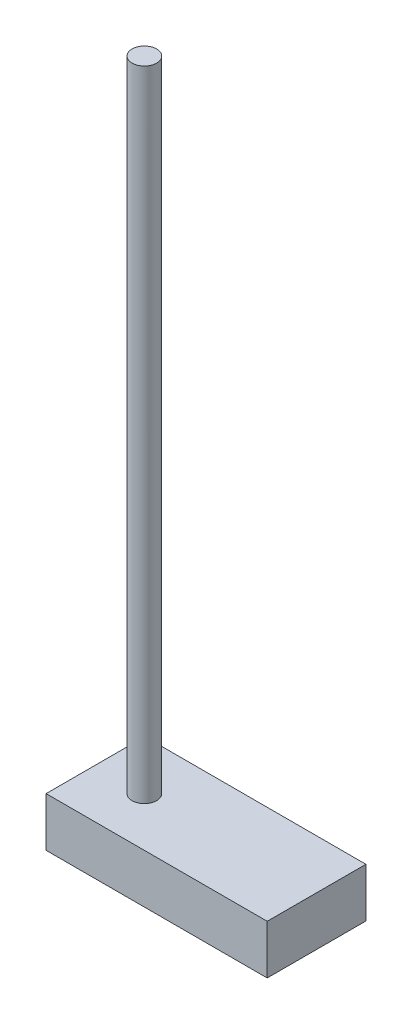
ISO-10303-21;
HEADER;
FILE_DESCRIPTION(('STEP AP214'),'2;1');
FILE_NAME('part.step','',(''),(''),'','','');
FILE_SCHEMA(('AUTOMOTIVE_DESIGN { 1 0 10303 214 1 1 1 1 }'));
ENDSEC;
DATA;
#1=APPLICATION_CONTEXT('core data for automotive mechanical design processes');
#2=APPLICATION_PROTOCOL_DEFINITION('international standard','automotive_design',2000,#1);
#3=PRODUCT_CONTEXT('',#1,'mechanical');
#4=PRODUCT('Part','Part','',(#3));
#5=PRODUCT_RELATED_PRODUCT_CATEGORY('part','',(#4));
#6=PRODUCT_DEFINITION_FORMATION('','',#4);
#7=PRODUCT_DEFINITION_CONTEXT('part definition',#1,'design');
#8=PRODUCT_DEFINITION('design','',#6,#7);
#9=PRODUCT_DEFINITION_SHAPE('','',#8);
#10=(LENGTH_UNIT() NAMED_UNIT(*) SI_UNIT(.MILLI.,.METRE.));
#11=(NAMED_UNIT(*) PLANE_ANGLE_UNIT() SI_UNIT($,.RADIAN.));
#12=(NAMED_UNIT(*) SI_UNIT($,.STERADIAN.) SOLID_ANGLE_UNIT());
#13=UNCERTAINTY_MEASURE_WITH_UNIT(LENGTH_MEASURE(1.E-05),#10,'distance_accuracy_value','');
#14=(GEOMETRIC_REPRESENTATION_CONTEXT(3) GLOBAL_UNCERTAINTY_ASSIGNED_CONTEXT((#13)) GLOBAL_UNIT_ASSIGNED_CONTEXT((#10,
#11,#12)) REPRESENTATION_CONTEXT('',''));
#15=CARTESIAN_POINT('',(0.,0.,0.));
#16=DIRECTION('',(0.,0.,1.));
#17=DIRECTION('',(1.,0.,0.));
#18=AXIS2_PLACEMENT_3D('',#15,#16,#17);
#19=CARTESIAN_POINT('',(0.,20.,0.));
#20=DIRECTION('',(0.,-1.,0.));
#21=DIRECTION('',(0.,0.,-1.));
#22=AXIS2_PLACEMENT_3D('',#19,#20,#21);
#23=CYLINDRICAL_SURFACE('',#22,2.5);
#24=CARTESIAN_POINT('',(0.,0.,0.));
#25=DIRECTION('',(0.,-1.,0.));
#26=DIRECTION('',(0.,0.,-1.));
#27=AXIS2_PLACEMENT_3D('',#24,#25,#26);
#28=CIRCLE('',#27,2.5);
#29=CARTESIAN_POINT('',(0.,0.,-2.5));
#30=VERTEX_POINT('',#29);
#31=EDGE_CURVE('E11',#30,#30,#28,.T.);
#32=ORIENTED_EDGE('',*,*,#31,.F.);
#33=EDGE_LOOP('',(#32));
#34=FACE_BOUND('',#33,.T.);
#35=CARTESIAN_POINT('',(0.,130.,0.));
#36=DIRECTION('',(0.,1.,0.));
#37=DIRECTION('',(0.,0.,1.));
#38=AXIS2_PLACEMENT_3D('',#35,#36,#37);
#39=CIRCLE('',#38,2.50000000000061);
#40=CARTESIAN_POINT('',(0.,130.,2.50000000000061));
#41=VERTEX_POINT('',#40);
#42=EDGE_CURVE('E102',#41,#41,#39,.T.);
#43=ORIENTED_EDGE('',*,*,#42,.F.);
#44=EDGE_LOOP('',(#43));
#45=FACE_BOUND('',#44,.T.);
#46=ADVANCED_FACE('F33',(#34,#45),#23,.T.);
#47=CARTESIAN_POINT('',(0.,0.,0.));
#48=DIRECTION('',(0.,-1.,0.));
#49=DIRECTION('',(0.,0.,-1.));
#50=AXIS2_PLACEMENT_3D('',#47,#48,#49);
#51=PLANE('',#50);
#52=DIRECTION('',(0.,0.,-1.));
#53=VECTOR('',#52,1.);
#54=CARTESIAN_POINT('',(-10.,0.,10.));
#55=LINE('',#54,#53);
#56=CARTESIAN_POINT('',(-10.,0.,10.));
#57=VERTEX_POINT('',#56);
#58=CARTESIAN_POINT('',(-10.,0.,-10.0875672703907));
#59=VERTEX_POINT('',#58);
#60=EDGE_CURVE('E99',#57,#59,#55,.T.);
#61=ORIENTED_EDGE('',*,*,#60,.F.);
#62=DIRECTION('',(-1.,0.,0.));
#63=VECTOR('',#62,1.);
#64=CARTESIAN_POINT('',(-10.,0.,10.));
#65=LINE('',#64,#63);
#66=CARTESIAN_POINT('',(35.0000000000096,0.,9.99999999999999));
#67=VERTEX_POINT('',#66);
#68=EDGE_CURVE('E72',#67,#57,#65,.T.);
#69=ORIENTED_EDGE('',*,*,#68,.F.);
#70=DIRECTION('',(0.,0.,1.));
#71=VECTOR('',#70,1.);
#72=CARTESIAN_POINT('',(35.0000000000096,0.,9.99999999999999));
#73=LINE('',#72,#71);
#74=CARTESIAN_POINT('',(35.0000000000096,0.,-10.0875672703907));
#75=VERTEX_POINT('',#74);
#76=EDGE_CURVE('E66',#75,#67,#73,.T.);
#77=ORIENTED_EDGE('',*,*,#76,.F.);
#78=DIRECTION('',(1.,0.,0.));
#79=VECTOR('',#78,1.);
#80=CARTESIAN_POINT('',(-10.,0.,-10.0875672703907));
#81=LINE('',#80,#79);
#82=EDGE_CURVE('E90',#59,#75,#81,.T.);
#83=ORIENTED_EDGE('',*,*,#82,.F.);
#84=EDGE_LOOP('',(#61,#69,#77,#83));
#85=FACE_BOUND('',#84,.T.);
#86=ORIENTED_EDGE('',*,*,#31,.T.);
#87=EDGE_LOOP('',(#86));
#88=FACE_BOUND('',#87,.T.);
#89=ADVANCED_FACE('F111',(#85,#88),#51,.F.);
#90=CARTESIAN_POINT('',(-10.,-10.,10.));
#91=DIRECTION('',(1.,0.,0.));
#92=DIRECTION('',(0.,0.,-1.));
#93=AXIS2_PLACEMENT_3D('',#90,#91,#92);
#94=PLANE('',#93);
#95=ORIENTED_EDGE('',*,*,#60,.T.);
#96=DIRECTION('',(0.,1.,0.));
#97=VECTOR('',#96,1.);
#98=CARTESIAN_POINT('',(-10.,-10.,-10.0875672703907));
#99=LINE('',#98,#97);
#100=CARTESIAN_POINT('',(-10.,-10.,-10.0875672703907));
#101=VERTEX_POINT('',#100);
#102=EDGE_CURVE('E41',#101,#59,#99,.T.);
#103=ORIENTED_EDGE('',*,*,#102,.F.);
#104=DIRECTION('',(0.,0.,-1.));
#105=VECTOR('',#104,1.);
#106=CARTESIAN_POINT('',(-10.,-10.,10.));
#107=LINE('',#106,#105);
#108=CARTESIAN_POINT('',(-10.,-10.,10.));
#109=VERTEX_POINT('',#108);
#110=EDGE_CURVE('E85',#109,#101,#107,.T.);
#111=ORIENTED_EDGE('',*,*,#110,.F.);
#112=DIRECTION('',(0.,1.,0.));
#113=VECTOR('',#112,1.);
#114=CARTESIAN_POINT('',(-10.,-10.,10.));
#115=LINE('',#114,#113);
#116=EDGE_CURVE('E95',#109,#57,#115,.T.);
#117=ORIENTED_EDGE('',*,*,#116,.T.);
#118=EDGE_LOOP('',(#95,#103,#111,#117));
#119=FACE_BOUND('',#118,.T.);
#120=ADVANCED_FACE('F109',(#119),#94,.F.);
#121=CARTESIAN_POINT('',(-10.,-10.,-10.0875672703907));
#122=DIRECTION('',(0.,0.,1.));
#123=DIRECTION('',(1.,0.,0.));
#124=AXIS2_PLACEMENT_3D('',#121,#122,#123);
#125=PLANE('',#124);
#126=ORIENTED_EDGE('',*,*,#82,.T.);
#127=DIRECTION('',(0.,1.,0.));
#128=VECTOR('',#127,1.);
#129=CARTESIAN_POINT('',(35.0000000000096,-10.,-10.0875672703907));
#130=LINE('',#129,#128);
#131=CARTESIAN_POINT('',(35.0000000000096,-10.,-10.0875672703907));
#132=VERTEX_POINT('',#131);
#133=EDGE_CURVE('E88',#132,#75,#130,.T.);
#134=ORIENTED_EDGE('',*,*,#133,.F.);
#135=DIRECTION('',(1.,0.,0.));
#136=VECTOR('',#135,1.);
#137=CARTESIAN_POINT('',(-10.,-10.,-10.0875672703907));
#138=LINE('',#137,#136);
#139=EDGE_CURVE('E80',#101,#132,#138,.T.);
#140=ORIENTED_EDGE('',*,*,#139,.F.);
#141=ORIENTED_EDGE('',*,*,#102,.T.);
#142=EDGE_LOOP('',(#126,#134,#140,#141));
#143=FACE_BOUND('',#142,.T.);
#144=ADVANCED_FACE('F89',(#143),#125,.F.);
#145=CARTESIAN_POINT('',(35.0000000000096,-10.,9.99999999999999));
#146=DIRECTION('',(-1.,0.,0.));
#147=DIRECTION('',(0.,0.,1.));
#148=AXIS2_PLACEMENT_3D('',#145,#146,#147);
#149=PLANE('',#148);
#150=ORIENTED_EDGE('',*,*,#76,.T.);
#151=DIRECTION('',(0.,1.,0.));
#152=VECTOR('',#151,1.);
#153=CARTESIAN_POINT('',(35.0000000000096,-10.,9.99999999999999));
#154=LINE('',#153,#152);
#155=CARTESIAN_POINT('',(35.0000000000096,-10.,9.99999999999999));
#156=VERTEX_POINT('',#155);
#157=EDGE_CURVE('E91',#156,#67,#154,.T.);
#158=ORIENTED_EDGE('',*,*,#157,.F.);
#159=DIRECTION('',(0.,0.,1.));
#160=VECTOR('',#159,1.);
#161=CARTESIAN_POINT('',(35.0000000000096,-10.,9.99999999999999));
#162=LINE('',#161,#160);
#163=EDGE_CURVE('E83',#132,#156,#162,.T.);
#164=ORIENTED_EDGE('',*,*,#163,.F.);
#165=ORIENTED_EDGE('',*,*,#133,.T.);
#166=EDGE_LOOP('',(#150,#158,#164,#165));
#167=FACE_BOUND('',#166,.T.);
#168=ADVANCED_FACE('F93',(#167),#149,.F.);
#169=CARTESIAN_POINT('',(-10.,-10.,10.));
#170=DIRECTION('',(0.,0.,-1.));
#171=DIRECTION('',(-1.,0.,0.));
#172=AXIS2_PLACEMENT_3D('',#169,#170,#171);
#173=PLANE('',#172);
#174=ORIENTED_EDGE('',*,*,#68,.T.);
#175=ORIENTED_EDGE('',*,*,#116,.F.);
#176=DIRECTION('',(-1.,0.,0.));
#177=VECTOR('',#176,1.);
#178=CARTESIAN_POINT('',(-10.,-10.,10.));
#179=LINE('',#178,#177);
#180=EDGE_CURVE('E49',#156,#109,#179,.T.);
#181=ORIENTED_EDGE('',*,*,#180,.F.);
#182=ORIENTED_EDGE('',*,*,#157,.T.);
#183=EDGE_LOOP('',(#174,#175,#181,#182));
#184=FACE_BOUND('',#183,.T.);
#185=ADVANCED_FACE('F129',(#184),#173,.F.);
#186=CARTESIAN_POINT('',(0.,-10.,0.));
#187=DIRECTION('',(0.,-1.,0.));
#188=DIRECTION('',(0.,0.,-1.));
#189=AXIS2_PLACEMENT_3D('',#186,#187,#188);
#190=PLANE('',#189);
#191=ORIENTED_EDGE('',*,*,#110,.T.);
#192=ORIENTED_EDGE('',*,*,#139,.T.);
#193=ORIENTED_EDGE('',*,*,#163,.T.);
#194=ORIENTED_EDGE('',*,*,#180,.T.);
#195=EDGE_LOOP('',(#191,#192,#193,#194));
#196=FACE_BOUND('',#195,.T.);
#197=ADVANCED_FACE('F81',(#196),#190,.T.);
#198=CARTESIAN_POINT('',(0.,130.,0.));
#199=DIRECTION('',(0.,1.,0.));
#200=DIRECTION('',(0.,0.,1.));
#201=AXIS2_PLACEMENT_3D('',#198,#199,#200);
#202=PLANE('',#201);
#203=ORIENTED_EDGE('',*,*,#42,.T.);
#204=EDGE_LOOP('',(#203));
#205=FACE_BOUND('',#204,.T.);
#206=ADVANCED_FACE('F123',(#205),#202,.T.);
#207=CLOSED_SHELL('',(#46,#89,#120,#144,#168,#185,#197,#206));
#208=MANIFOLD_SOLID_BREP('B2',#207);
#209=ADVANCED_BREP_SHAPE_REPRESENTATION('',(#18,#208),#14);
#210=SHAPE_DEFINITION_REPRESENTATION(#9,#209);
ENDSEC;
END-ISO-10303-21;
